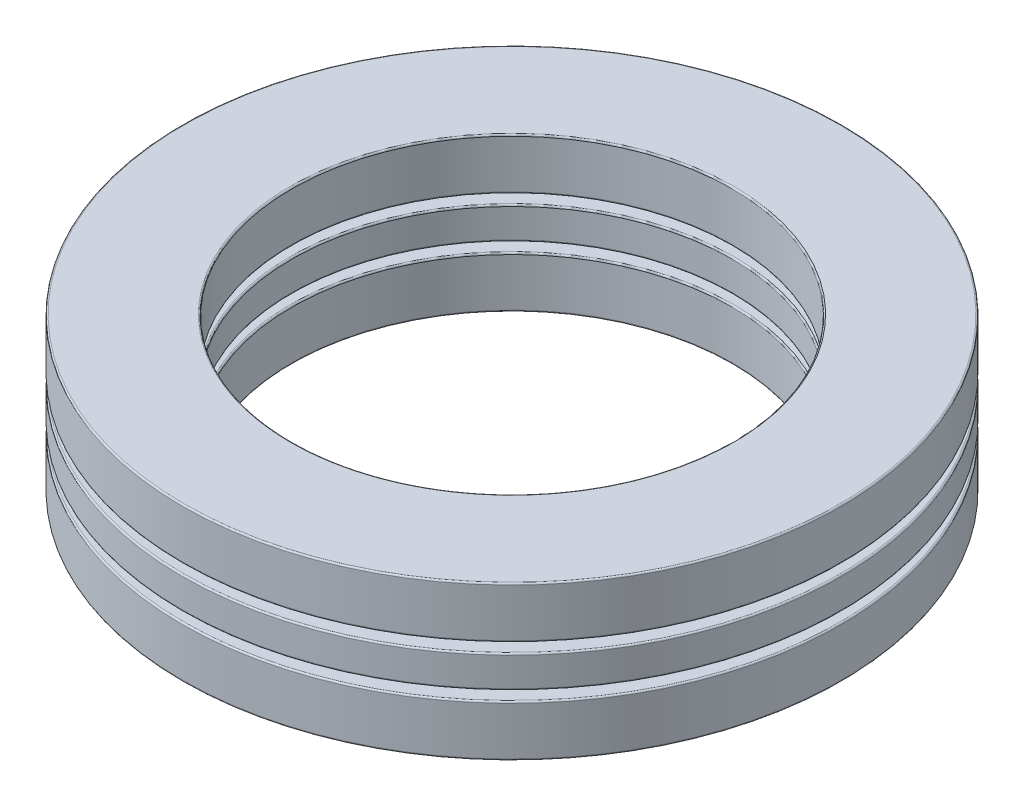
ISO-10303-21;
HEADER;
FILE_DESCRIPTION(('STEP AP214'),'2;1');
FILE_NAME('part.step','',(''),(''),'','','');
FILE_SCHEMA(('AUTOMOTIVE_DESIGN { 1 0 10303 214 1 1 1 1 }'));
ENDSEC;
DATA;
#1=APPLICATION_CONTEXT('core data for automotive mechanical design processes');
#2=APPLICATION_PROTOCOL_DEFINITION('international standard','automotive_design',2000,#1);
#3=PRODUCT_CONTEXT('',#1,'mechanical');
#4=PRODUCT('Part','Part','',(#3));
#5=PRODUCT_RELATED_PRODUCT_CATEGORY('part','',(#4));
#6=PRODUCT_DEFINITION_FORMATION('','',#4);
#7=PRODUCT_DEFINITION_CONTEXT('part definition',#1,'design');
#8=PRODUCT_DEFINITION('design','',#6,#7);
#9=PRODUCT_DEFINITION_SHAPE('','',#8);
#10=(LENGTH_UNIT() NAMED_UNIT(*) SI_UNIT(.MILLI.,.METRE.));
#11=(NAMED_UNIT(*) PLANE_ANGLE_UNIT() SI_UNIT($,.RADIAN.));
#12=(NAMED_UNIT(*) SI_UNIT($,.STERADIAN.) SOLID_ANGLE_UNIT());
#13=UNCERTAINTY_MEASURE_WITH_UNIT(LENGTH_MEASURE(1.E-05),#10,'distance_accuracy_value','');
#14=(GEOMETRIC_REPRESENTATION_CONTEXT(3) GLOBAL_UNCERTAINTY_ASSIGNED_CONTEXT((#13)) GLOBAL_UNIT_ASSIGNED_CONTEXT((#10,
#11,#12)) REPRESENTATION_CONTEXT('',''));
#15=CARTESIAN_POINT('',(0.,0.,0.));
#16=DIRECTION('',(0.,0.,1.));
#17=DIRECTION('',(1.,0.,0.));
#18=AXIS2_PLACEMENT_3D('',#15,#16,#17);
#19=CARTESIAN_POINT('',(0.,-5.5499,0.));
#20=DIRECTION('',(0.,-1.,0.));
#21=DIRECTION('',(0.,0.,-1.));
#22=AXIS2_PLACEMENT_3D('',#19,#20,#21);
#23=CYLINDRICAL_SURFACE('',#22,23.8125);
#24=CARTESIAN_POINT('',(0.,-5.438902,0.));
#25=DIRECTION('',(0.,1.,0.));
#26=DIRECTION('',(0.,0.,1.));
#27=AXIS2_PLACEMENT_3D('',#24,#25,#26);
#28=CIRCLE('',#27,23.8125);
#29=CARTESIAN_POINT('',(0.,-5.438902,23.8125));
#30=VERTEX_POINT('',#29);
#31=EDGE_CURVE('E11',#30,#30,#28,.T.);
#32=ORIENTED_EDGE('',*,*,#31,.T.);
#33=EDGE_LOOP('',(#32));
#34=FACE_BOUND('',#33,.T.);
#35=CARTESIAN_POINT('',(0.,-1.96096466666666,0.));
#36=DIRECTION('',(0.,-1.,0.));
#37=DIRECTION('',(0.,0.,-1.));
#38=AXIS2_PLACEMENT_3D('',#35,#36,#37);
#39=CIRCLE('',#38,23.8125);
#40=CARTESIAN_POINT('',(0.,-1.96096466666666,-23.8125));
#41=VERTEX_POINT('',#40);
#42=EDGE_CURVE('E49',#41,#41,#39,.T.);
#43=ORIENTED_EDGE('',*,*,#42,.T.);
#44=EDGE_LOOP('',(#43));
#45=FACE_BOUND('',#44,.T.);
#46=ADVANCED_FACE('F42',(#34,#45),#23,.T.);
#47=CARTESIAN_POINT('',(0.,-1.84996666666666,23.8125));
#48=DIRECTION('',(0.,-1.,0.));
#49=DIRECTION('',(0.,0.,-1.));
#50=AXIS2_PLACEMENT_3D('',#47,#48,#49);
#51=PLANE('',#50);
#52=CARTESIAN_POINT('',(0.,-1.84996666666666,0.));
#53=DIRECTION('',(0.,-1.,0.));
#54=DIRECTION('',(0.,0.,-1.));
#55=AXIS2_PLACEMENT_3D('',#52,#53,#54);
#56=CIRCLE('',#55,16.024098);
#57=CARTESIAN_POINT('',(0.,-1.84996666666666,-16.024098));
#58=VERTEX_POINT('',#57);
#59=EDGE_CURVE('E53',#58,#58,#56,.T.);
#60=ORIENTED_EDGE('',*,*,#59,.T.);
#61=EDGE_LOOP('',(#60));
#62=FACE_BOUND('',#61,.T.);
#63=CARTESIAN_POINT('',(0.,-1.84996666666666,0.));
#64=DIRECTION('',(0.,-1.,0.));
#65=DIRECTION('',(0.,0.,-1.));
#66=AXIS2_PLACEMENT_3D('',#63,#64,#65);
#67=CIRCLE('',#66,23.701502);
#68=CARTESIAN_POINT('',(0.,-1.84996666666666,-23.701502));
#69=VERTEX_POINT('',#68);
#70=EDGE_CURVE('E57',#69,#69,#67,.F.);
#71=ORIENTED_EDGE('',*,*,#70,.T.);
#72=EDGE_LOOP('',(#71));
#73=FACE_BOUND('',#72,.T.);
#74=ADVANCED_FACE('F85',(#62,#73),#51,.F.);
#75=CARTESIAN_POINT('',(0.,-5.5499,0.));
#76=DIRECTION('',(0.,-1.,0.));
#77=DIRECTION('',(0.,0.,-1.));
#78=AXIS2_PLACEMENT_3D('',#75,#76,#77);
#79=CYLINDRICAL_SURFACE('',#78,15.9131);
#80=CARTESIAN_POINT('',(0.,-5.438902,0.));
#81=DIRECTION('',(0.,1.,0.));
#82=DIRECTION('',(0.,0.,1.));
#83=AXIS2_PLACEMENT_3D('',#80,#81,#82);
#84=CIRCLE('',#83,15.9131);
#85=CARTESIAN_POINT('',(0.,-5.438902,15.9131));
#86=VERTEX_POINT('',#85);
#87=EDGE_CURVE('E68',#86,#86,#84,.F.);
#88=ORIENTED_EDGE('',*,*,#87,.T.);
#89=EDGE_LOOP('',(#88));
#90=FACE_BOUND('',#89,.T.);
#91=CARTESIAN_POINT('',(0.,-1.96096466666666,0.));
#92=DIRECTION('',(0.,-1.,0.));
#93=DIRECTION('',(0.,0.,-1.));
#94=AXIS2_PLACEMENT_3D('',#91,#92,#93);
#95=CIRCLE('',#94,15.9131);
#96=CARTESIAN_POINT('',(0.,-1.96096466666666,-15.9131));
#97=VERTEX_POINT('',#96);
#98=EDGE_CURVE('E71',#97,#97,#95,.F.);
#99=ORIENTED_EDGE('',*,*,#98,.T.);
#100=EDGE_LOOP('',(#99));
#101=FACE_BOUND('',#100,.T.);
#102=ADVANCED_FACE('F75',(#90,#101),#79,.F.);
#103=CARTESIAN_POINT('',(0.,-5.5499,23.8125));
#104=DIRECTION('',(0.,1.,0.));
#105=DIRECTION('',(0.,0.,1.));
#106=AXIS2_PLACEMENT_3D('',#103,#104,#105);
#107=PLANE('',#106);
#108=CARTESIAN_POINT('',(0.,-5.5499,0.));
#109=DIRECTION('',(0.,1.,0.));
#110=DIRECTION('',(0.,0.,1.));
#111=AXIS2_PLACEMENT_3D('',#108,#109,#110);
#112=CIRCLE('',#111,16.024098);
#113=CARTESIAN_POINT('',(0.,-5.5499,16.024098));
#114=VERTEX_POINT('',#113);
#115=EDGE_CURVE('E62',#114,#114,#112,.T.);
#116=ORIENTED_EDGE('',*,*,#115,.T.);
#117=EDGE_LOOP('',(#116));
#118=FACE_BOUND('',#117,.T.);
#119=CARTESIAN_POINT('',(0.,-5.5499,0.));
#120=DIRECTION('',(0.,1.,0.));
#121=DIRECTION('',(0.,0.,1.));
#122=AXIS2_PLACEMENT_3D('',#119,#120,#121);
#123=CIRCLE('',#122,23.701502);
#124=CARTESIAN_POINT('',(0.,-5.5499,23.701502));
#125=VERTEX_POINT('',#124);
#126=EDGE_CURVE('E65',#125,#125,#123,.F.);
#127=ORIENTED_EDGE('',*,*,#126,.T.);
#128=EDGE_LOOP('',(#127));
#129=FACE_BOUND('',#128,.T.);
#130=ADVANCED_FACE('F104',(#118,#129),#107,.F.);
#131=CARTESIAN_POINT('',(0.,-5.438902,0.));
#132=DIRECTION('',(0.,1.,0.));
#133=DIRECTION('',(0.,0.,1.));
#134=AXIS2_PLACEMENT_3D('',#131,#132,#133);
#135=TOROIDAL_SURFACE('',#134,16.024098,0.110998);
#136=ORIENTED_EDGE('',*,*,#115,.F.);
#137=EDGE_LOOP('',(#136));
#138=FACE_BOUND('',#137,.T.);
#139=ORIENTED_EDGE('',*,*,#87,.F.);
#140=EDGE_LOOP('',(#139));
#141=FACE_BOUND('',#140,.T.);
#142=ADVANCED_FACE('F81',(#138,#141),#135,.T.);
#143=CARTESIAN_POINT('',(0.,-1.96096466666666,0.));
#144=DIRECTION('',(0.,-1.,0.));
#145=DIRECTION('',(0.,0.,-1.));
#146=AXIS2_PLACEMENT_3D('',#143,#144,#145);
#147=TOROIDAL_SURFACE('',#146,16.024098,0.110998);
#148=ORIENTED_EDGE('',*,*,#98,.F.);
#149=EDGE_LOOP('',(#148));
#150=FACE_BOUND('',#149,.T.);
#151=ORIENTED_EDGE('',*,*,#59,.F.);
#152=EDGE_LOOP('',(#151));
#153=FACE_BOUND('',#152,.T.);
#154=ADVANCED_FACE('F77',(#150,#153),#147,.T.);
#155=CARTESIAN_POINT('',(0.,-5.438902,0.));
#156=DIRECTION('',(0.,1.,0.));
#157=DIRECTION('',(0.,0.,1.));
#158=AXIS2_PLACEMENT_3D('',#155,#156,#157);
#159=TOROIDAL_SURFACE('',#158,23.701502,0.110998);
#160=ORIENTED_EDGE('',*,*,#31,.F.);
#161=EDGE_LOOP('',(#160));
#162=FACE_BOUND('',#161,.T.);
#163=ORIENTED_EDGE('',*,*,#126,.F.);
#164=EDGE_LOOP('',(#163));
#165=FACE_BOUND('',#164,.T.);
#166=ADVANCED_FACE('F80',(#162,#165),#159,.T.);
#167=CARTESIAN_POINT('',(0.,-1.96096466666666,0.));
#168=DIRECTION('',(0.,-1.,0.));
#169=DIRECTION('',(0.,0.,-1.));
#170=AXIS2_PLACEMENT_3D('',#167,#168,#169);
#171=TOROIDAL_SURFACE('',#170,23.701502,0.110998);
#172=ORIENTED_EDGE('',*,*,#70,.F.);
#173=EDGE_LOOP('',(#172));
#174=FACE_BOUND('',#173,.T.);
#175=ORIENTED_EDGE('',*,*,#42,.F.);
#176=EDGE_LOOP('',(#175));
#177=FACE_BOUND('',#176,.T.);
#178=ADVANCED_FACE('F44',(#174,#177),#171,.T.);
#179=CLOSED_SHELL('',(#46,#74,#102,#130,#142,#154,#166,#178));
#180=MANIFOLD_SOLID_BREP('B2_NOT_SHOWN',#179);
#181=CARTESIAN_POINT('',(0.,-5.5499,0.));
#182=DIRECTION('',(0.,-1.,0.));
#183=DIRECTION('',(0.,0.,-1.));
#184=AXIS2_PLACEMENT_3D('',#181,#182,#183);
#185=CYLINDRICAL_SURFACE('',#184,23.8125);
#186=CARTESIAN_POINT('',(0.,1.96096466666667,0.));
#187=DIRECTION('',(0.,1.,0.));
#188=DIRECTION('',(0.,0.,1.));
#189=AXIS2_PLACEMENT_3D('',#186,#187,#188);
#190=CIRCLE('',#189,23.8125);
#191=CARTESIAN_POINT('',(0.,1.96096466666667,23.8125));
#192=VERTEX_POINT('',#191);
#193=EDGE_CURVE('E41',#192,#192,#190,.T.);
#194=ORIENTED_EDGE('',*,*,#193,.T.);
#195=EDGE_LOOP('',(#194));
#196=FACE_BOUND('',#195,.T.);
#197=CARTESIAN_POINT('',(0.,5.438902,0.));
#198=DIRECTION('',(0.,-1.,0.));
#199=DIRECTION('',(0.,0.,-1.));
#200=AXIS2_PLACEMENT_3D('',#197,#198,#199);
#201=CIRCLE('',#200,23.8125);
#202=CARTESIAN_POINT('',(0.,5.438902,-23.8125));
#203=VERTEX_POINT('',#202);
#204=EDGE_CURVE('E177',#203,#203,#201,.T.);
#205=ORIENTED_EDGE('',*,*,#204,.T.);
#206=EDGE_LOOP('',(#205));
#207=FACE_BOUND('',#206,.T.);
#208=ADVANCED_FACE('F170',(#196,#207),#185,.T.);
#209=CARTESIAN_POINT('',(0.,5.5499,23.8125));
#210=DIRECTION('',(0.,-1.,0.));
#211=DIRECTION('',(0.,0.,-1.));
#212=AXIS2_PLACEMENT_3D('',#209,#210,#211);
#213=PLANE('',#212);
#214=CARTESIAN_POINT('',(0.,5.5499,0.));
#215=DIRECTION('',(0.,-1.,0.));
#216=DIRECTION('',(0.,0.,-1.));
#217=AXIS2_PLACEMENT_3D('',#214,#215,#216);
#218=CIRCLE('',#217,16.024098);
#219=CARTESIAN_POINT('',(0.,5.5499,-16.024098));
#220=VERTEX_POINT('',#219);
#221=EDGE_CURVE('E181',#220,#220,#218,.T.);
#222=ORIENTED_EDGE('',*,*,#221,.T.);
#223=EDGE_LOOP('',(#222));
#224=FACE_BOUND('',#223,.T.);
#225=CARTESIAN_POINT('',(0.,5.5499,0.));
#226=DIRECTION('',(0.,-1.,0.));
#227=DIRECTION('',(0.,0.,-1.));
#228=AXIS2_PLACEMENT_3D('',#225,#226,#227);
#229=CIRCLE('',#228,23.701502);
#230=CARTESIAN_POINT('',(0.,5.5499,-23.701502));
#231=VERTEX_POINT('',#230);
#232=EDGE_CURVE('E185',#231,#231,#229,.F.);
#233=ORIENTED_EDGE('',*,*,#232,.T.);
#234=EDGE_LOOP('',(#233));
#235=FACE_BOUND('',#234,.T.);
#236=ADVANCED_FACE('F213',(#224,#235),#213,.F.);
#237=CARTESIAN_POINT('',(0.,-5.5499,0.));
#238=DIRECTION('',(0.,-1.,0.));
#239=DIRECTION('',(0.,0.,-1.));
#240=AXIS2_PLACEMENT_3D('',#237,#238,#239);
#241=CYLINDRICAL_SURFACE('',#240,15.9131);
#242=CARTESIAN_POINT('',(0.,1.96096466666667,0.));
#243=DIRECTION('',(0.,1.,0.));
#244=DIRECTION('',(0.,0.,1.));
#245=AXIS2_PLACEMENT_3D('',#242,#243,#244);
#246=CIRCLE('',#245,15.9131);
#247=CARTESIAN_POINT('',(0.,1.96096466666667,15.9131));
#248=VERTEX_POINT('',#247);
#249=EDGE_CURVE('E196',#248,#248,#246,.F.);
#250=ORIENTED_EDGE('',*,*,#249,.T.);
#251=EDGE_LOOP('',(#250));
#252=FACE_BOUND('',#251,.T.);
#253=CARTESIAN_POINT('',(0.,5.438902,0.));
#254=DIRECTION('',(0.,-1.,0.));
#255=DIRECTION('',(0.,0.,-1.));
#256=AXIS2_PLACEMENT_3D('',#253,#254,#255);
#257=CIRCLE('',#256,15.9131);
#258=CARTESIAN_POINT('',(0.,5.438902,-15.9131));
#259=VERTEX_POINT('',#258);
#260=EDGE_CURVE('E199',#259,#259,#257,.F.);
#261=ORIENTED_EDGE('',*,*,#260,.T.);
#262=EDGE_LOOP('',(#261));
#263=FACE_BOUND('',#262,.T.);
#264=ADVANCED_FACE('F203',(#252,#263),#241,.F.);
#265=CARTESIAN_POINT('',(0.,1.84996666666667,23.8125));
#266=DIRECTION('',(0.,1.,0.));
#267=DIRECTION('',(0.,0.,1.));
#268=AXIS2_PLACEMENT_3D('',#265,#266,#267);
#269=PLANE('',#268);
#270=CARTESIAN_POINT('',(0.,1.84996666666667,0.));
#271=DIRECTION('',(0.,1.,0.));
#272=DIRECTION('',(0.,0.,1.));
#273=AXIS2_PLACEMENT_3D('',#270,#271,#272);
#274=CIRCLE('',#273,16.024098);
#275=CARTESIAN_POINT('',(0.,1.84996666666667,16.024098));
#276=VERTEX_POINT('',#275);
#277=EDGE_CURVE('E190',#276,#276,#274,.T.);
#278=ORIENTED_EDGE('',*,*,#277,.T.);
#279=EDGE_LOOP('',(#278));
#280=FACE_BOUND('',#279,.T.);
#281=CARTESIAN_POINT('',(0.,1.84996666666667,0.));
#282=DIRECTION('',(0.,1.,0.));
#283=DIRECTION('',(0.,0.,1.));
#284=AXIS2_PLACEMENT_3D('',#281,#282,#283);
#285=CIRCLE('',#284,23.701502);
#286=CARTESIAN_POINT('',(0.,1.84996666666667,23.701502));
#287=VERTEX_POINT('',#286);
#288=EDGE_CURVE('E193',#287,#287,#285,.F.);
#289=ORIENTED_EDGE('',*,*,#288,.T.);
#290=EDGE_LOOP('',(#289));
#291=FACE_BOUND('',#290,.T.);
#292=ADVANCED_FACE('F232',(#280,#291),#269,.F.);
#293=CARTESIAN_POINT('',(0.,1.96096466666667,0.));
#294=DIRECTION('',(0.,1.,0.));
#295=DIRECTION('',(0.,0.,1.));
#296=AXIS2_PLACEMENT_3D('',#293,#294,#295);
#297=TOROIDAL_SURFACE('',#296,16.024098,0.110998);
#298=ORIENTED_EDGE('',*,*,#277,.F.);
#299=EDGE_LOOP('',(#298));
#300=FACE_BOUND('',#299,.T.);
#301=ORIENTED_EDGE('',*,*,#249,.F.);
#302=EDGE_LOOP('',(#301));
#303=FACE_BOUND('',#302,.T.);
#304=ADVANCED_FACE('F209',(#300,#303),#297,.T.);
#305=CARTESIAN_POINT('',(0.,5.438902,0.));
#306=DIRECTION('',(0.,-1.,0.));
#307=DIRECTION('',(0.,0.,-1.));
#308=AXIS2_PLACEMENT_3D('',#305,#306,#307);
#309=TOROIDAL_SURFACE('',#308,16.024098,0.110998);
#310=ORIENTED_EDGE('',*,*,#260,.F.);
#311=EDGE_LOOP('',(#310));
#312=FACE_BOUND('',#311,.T.);
#313=ORIENTED_EDGE('',*,*,#221,.F.);
#314=EDGE_LOOP('',(#313));
#315=FACE_BOUND('',#314,.T.);
#316=ADVANCED_FACE('F205',(#312,#315),#309,.T.);
#317=CARTESIAN_POINT('',(0.,1.96096466666667,0.));
#318=DIRECTION('',(0.,1.,0.));
#319=DIRECTION('',(0.,0.,1.));
#320=AXIS2_PLACEMENT_3D('',#317,#318,#319);
#321=TOROIDAL_SURFACE('',#320,23.701502,0.110998);
#322=ORIENTED_EDGE('',*,*,#193,.F.);
#323=EDGE_LOOP('',(#322));
#324=FACE_BOUND('',#323,.T.);
#325=ORIENTED_EDGE('',*,*,#288,.F.);
#326=EDGE_LOOP('',(#325));
#327=FACE_BOUND('',#326,.T.);
#328=ADVANCED_FACE('F208',(#324,#327),#321,.T.);
#329=CARTESIAN_POINT('',(0.,5.438902,0.));
#330=DIRECTION('',(0.,-1.,0.));
#331=DIRECTION('',(0.,0.,-1.));
#332=AXIS2_PLACEMENT_3D('',#329,#330,#331);
#333=TOROIDAL_SURFACE('',#332,23.701502,0.110998);
#334=ORIENTED_EDGE('',*,*,#232,.F.);
#335=EDGE_LOOP('',(#334));
#336=FACE_BOUND('',#335,.T.);
#337=ORIENTED_EDGE('',*,*,#204,.F.);
#338=EDGE_LOOP('',(#337));
#339=FACE_BOUND('',#338,.T.);
#340=ADVANCED_FACE('F172',(#336,#339),#333,.T.);
#341=CLOSED_SHELL('',(#208,#236,#264,#292,#304,#316,#328,#340));
#342=MANIFOLD_SOLID_BREP('B6_NOT_SHOWN',#341);
#343=CARTESIAN_POINT('',(-12.7675617336816,0.,15.2157875647838));
#344=DIRECTION('',(0.,1.,0.));
#345=DIRECTION('',(0.64278760968653,0.,-0.766044443118986));
#346=AXIS2_PLACEMENT_3D('',#343,#344,#345);
#347=SPHERICAL_SURFACE('',#346,1.84996666666667);
#348=CARTESIAN_POINT('',(-12.7675617336816,1.84996666666667,15.2157875647838));
#349=VERTEX_POINT('',#348);
#350=VERTEX_LOOP('',#349);
#351=FACE_BOUND('',#350,.T.);
#352=ADVANCED_FACE('F298',(#351),#347,.T.);
#353=CLOSED_SHELL('',(#352));
#354=MANIFOLD_SOLID_BREP('B36',#353);
#355=CARTESIAN_POINT('',(-19.5610394365308,0.,3.4491390233629));
#356=DIRECTION('',(0.,1.,0.));
#357=DIRECTION('',(0.984807753012206,0.,-0.17364817766694));
#358=AXIS2_PLACEMENT_3D('',#355,#356,#357);
#359=SPHERICAL_SURFACE('',#358,1.84996666666667);
#360=CARTESIAN_POINT('',(-19.5610394365308,1.84996666666667,3.4491390233629));
#361=VERTEX_POINT('',#360);
#362=VERTEX_LOOP('',#361);
#363=FACE_BOUND('',#362,.T.);
#364=ADVANCED_FACE('F317',(#363),#359,.T.);
#365=CLOSED_SHELL('',(#364));
#366=MANIFOLD_SOLID_BREP('B166',#365);
#367=CARTESIAN_POINT('',(-17.2016893902896,0.,-9.93139999999984));
#368=DIRECTION('',(0.,1.,0.));
#369=DIRECTION('',(0.866025403784443,0.,0.499999999999992));
#370=AXIS2_PLACEMENT_3D('',#367,#368,#369);
#371=SPHERICAL_SURFACE('',#370,1.84996666666667);
#372=CARTESIAN_POINT('',(-17.2016893902896,1.84996666666667,-9.93139999999984));
#373=VERTEX_POINT('',#372);
#374=VERTEX_LOOP('',#373);
#375=FACE_BOUND('',#374,.T.);
#376=ADVANCED_FACE('F336',(#375),#371,.T.);
#377=CLOSED_SHELL('',(#376));
#378=MANIFOLD_SOLID_BREP('B294',#377);
#379=CARTESIAN_POINT('',(-6.79347770284923,0.,-18.6649265881463));
#380=DIRECTION('',(0.,1.,0.));
#381=DIRECTION('',(0.342020143325676,0.,0.939692620785906));
#382=AXIS2_PLACEMENT_3D('',#379,#380,#381);
#383=SPHERICAL_SURFACE('',#382,1.84996666666667);
#384=CARTESIAN_POINT('',(-6.79347770284923,1.84996666666667,-18.6649265881463));
#385=VERTEX_POINT('',#384);
#386=VERTEX_LOOP('',#385);
#387=FACE_BOUND('',#386,.T.);
#388=ADVANCED_FACE('F355',(#387),#383,.T.);
#389=CLOSED_SHELL('',(#388));
#390=MANIFOLD_SOLID_BREP('B313',#389);
#391=CARTESIAN_POINT('',(6.79347770284898,0.,-18.6649265881464));
#392=DIRECTION('',(0.,1.,0.));
#393=DIRECTION('',(-0.342020143325663,0.,0.939692620785911));
#394=AXIS2_PLACEMENT_3D('',#391,#392,#393);
#395=SPHERICAL_SURFACE('',#394,1.84996666666667);
#396=CARTESIAN_POINT('',(6.79347770284898,1.84996666666667,-18.6649265881464));
#397=VERTEX_POINT('',#396);
#398=VERTEX_LOOP('',#397);
#399=FACE_BOUND('',#398,.T.);
#400=ADVANCED_FACE('F374',(#399),#395,.T.);
#401=CLOSED_SHELL('',(#400));
#402=MANIFOLD_SOLID_BREP('B332',#401);
#403=CARTESIAN_POINT('',(17.2016893902895,0.,-9.93140000000008));
#404=DIRECTION('',(0.,1.,0.));
#405=DIRECTION('',(-0.866025403784436,0.,0.500000000000004));
#406=AXIS2_PLACEMENT_3D('',#403,#404,#405);
#407=SPHERICAL_SURFACE('',#406,1.84996666666667);
#408=CARTESIAN_POINT('',(17.2016893902895,1.84996666666667,-9.93140000000008));
#409=VERTEX_POINT('',#408);
#410=VERTEX_LOOP('',#409);
#411=FACE_BOUND('',#410,.T.);
#412=ADVANCED_FACE('F393',(#411),#407,.T.);
#413=CLOSED_SHELL('',(#412));
#414=MANIFOLD_SOLID_BREP('B351',#413);
#415=CARTESIAN_POINT('',(19.5610394365309,0.,3.44913902336264));
#416=DIRECTION('',(0.,1.,0.));
#417=DIRECTION('',(-0.984807753012209,0.,-0.173648177666927));
#418=AXIS2_PLACEMENT_3D('',#415,#416,#417);
#419=SPHERICAL_SURFACE('',#418,1.84996666666667);
#420=CARTESIAN_POINT('',(19.5610394365309,1.84996666666667,3.44913902336264));
#421=VERTEX_POINT('',#420);
#422=VERTEX_LOOP('',#421);
#423=FACE_BOUND('',#422,.T.);
#424=ADVANCED_FACE('F412',(#423),#419,.T.);
#425=CLOSED_SHELL('',(#424));
#426=MANIFOLD_SOLID_BREP('B370',#425);
#427=CARTESIAN_POINT('',(12.7675617336818,0.,15.2157875647836));
#428=DIRECTION('',(0.,1.,0.));
#429=DIRECTION('',(-0.642787609686541,0.,-0.766044443118977));
#430=AXIS2_PLACEMENT_3D('',#427,#428,#429);
#431=SPHERICAL_SURFACE('',#430,1.84996666666667);
#432=CARTESIAN_POINT('',(12.7675617336818,1.84996666666667,15.2157875647836));
#433=VERTEX_POINT('',#432);
#434=VERTEX_LOOP('',#433);
#435=FACE_BOUND('',#434,.T.);
#436=ADVANCED_FACE('F431',(#435),#431,.T.);
#437=CLOSED_SHELL('',(#436));
#438=MANIFOLD_SOLID_BREP('B389',#437);
#439=CARTESIAN_POINT('',(0.,0.,19.8628));
#440=DIRECTION('',(0.,1.,0.));
#441=DIRECTION('',(0.,0.,-1.));
#442=AXIS2_PLACEMENT_3D('',#439,#440,#441);
#443=SPHERICAL_SURFACE('',#442,1.84996666666667);
#444=CARTESIAN_POINT('',(0.,1.84996666666667,19.8628));
#445=VERTEX_POINT('',#444);
#446=VERTEX_LOOP('',#445);
#447=FACE_BOUND('',#446,.T.);
#448=ADVANCED_FACE('F451',(#447),#443,.T.);
#449=CLOSED_SHELL('',(#448));
#450=MANIFOLD_SOLID_BREP('B408',#449);
#451=CARTESIAN_POINT('',(0.,-5.5499,0.));
#452=DIRECTION('',(0.,-1.,0.));
#453=DIRECTION('',(0.,0.,-1.));
#454=AXIS2_PLACEMENT_3D('',#451,#452,#453);
#455=CYLINDRICAL_SURFACE('',#454,23.8125);
#456=CARTESIAN_POINT('',(0.,-1.04523116666667,0.));
#457=DIRECTION('',(0.,1.,0.));
#458=DIRECTION('',(0.,0.,1.));
#459=AXIS2_PLACEMENT_3D('',#456,#457,#458);
#460=CIRCLE('',#459,23.8125);
#461=CARTESIAN_POINT('',(0.,-1.04523116666667,23.8125));
#462=VERTEX_POINT('',#461);
#463=EDGE_CURVE('E450',#462,#462,#460,.T.);
#464=ORIENTED_EDGE('',*,*,#463,.T.);
#465=EDGE_LOOP('',(#464));
#466=FACE_BOUND('',#465,.T.);
#467=CARTESIAN_POINT('',(0.,1.04523116666666,0.));
#468=DIRECTION('',(0.,-1.,0.));
#469=DIRECTION('',(0.,0.,-1.));
#470=AXIS2_PLACEMENT_3D('',#467,#468,#469);
#471=CIRCLE('',#470,23.8125);
#472=CARTESIAN_POINT('',(0.,1.04523116666666,-23.8125));
#473=VERTEX_POINT('',#472);
#474=EDGE_CURVE('E471',#473,#473,#471,.T.);
#475=ORIENTED_EDGE('',*,*,#474,.T.);
#476=EDGE_LOOP('',(#475));
#477=FACE_BOUND('',#476,.T.);
#478=ADVANCED_FACE('F464',(#466,#477),#455,.T.);
#479=CARTESIAN_POINT('',(0.,-1.15622916666667,23.8125));
#480=DIRECTION('',(0.,1.,0.));
#481=DIRECTION('',(0.,0.,1.));
#482=AXIS2_PLACEMENT_3D('',#479,#480,#481);
#483=PLANE('',#482);
#484=CARTESIAN_POINT('',(0.,-1.15622916666667,0.));
#485=DIRECTION('',(0.,1.,0.));
#486=DIRECTION('',(0.,0.,1.));
#487=AXIS2_PLACEMENT_3D('',#484,#485,#486);
#488=CIRCLE('',#487,16.024098);
#489=CARTESIAN_POINT('',(0.,-1.15622916666667,16.024098));
#490=VERTEX_POINT('',#489);
#491=EDGE_CURVE('E484',#490,#490,#488,.T.);
#492=ORIENTED_EDGE('',*,*,#491,.T.);
#493=EDGE_LOOP('',(#492));
#494=FACE_BOUND('',#493,.T.);
#495=CARTESIAN_POINT('',(0.,-1.15622916666667,0.));
#496=DIRECTION('',(0.,1.,0.));
#497=DIRECTION('',(0.,0.,1.));
#498=AXIS2_PLACEMENT_3D('',#495,#496,#497);
#499=CIRCLE('',#498,23.701502);
#500=CARTESIAN_POINT('',(0.,-1.15622916666667,23.701502));
#501=VERTEX_POINT('',#500);
#502=EDGE_CURVE('E487',#501,#501,#499,.F.);
#503=ORIENTED_EDGE('',*,*,#502,.T.);
#504=EDGE_LOOP('',(#503));
#505=FACE_BOUND('',#504,.T.);
#506=CARTESIAN_POINT('',(-12.7675617336816,-1.15622916666667,15.2157875647838));
#507=DIRECTION('',(0.,1.,0.));
#508=DIRECTION('',(-0.64278760968653,0.,0.766044443118986));
#509=AXIS2_PLACEMENT_3D('',#506,#507,#508);
#510=CIRCLE('',#509,1.44412976630463);
#511=CARTESIAN_POINT('',(-13.6958304542417,-1.15622916666667,16.3220551474042));
#512=VERTEX_POINT('',#511);
#513=EDGE_CURVE('E544',#512,#512,#510,.T.);
#514=ORIENTED_EDGE('',*,*,#513,.T.);
#515=EDGE_LOOP('',(#514));
#516=FACE_BOUND('',#515,.T.);
#517=CARTESIAN_POINT('',(-19.5610394365308,-1.15622916666667,3.4491390233629));
#518=DIRECTION('',(0.,1.,0.));
#519=DIRECTION('',(-0.984807753012206,0.,0.17364817766694));
#520=AXIS2_PLACEMENT_3D('',#517,#518,#519);
#521=CIRCLE('',#520,1.44412976630463);
#522=CARTESIAN_POINT('',(-20.9832296267434,-1.15622916666667,3.69990952559629));
#523=VERTEX_POINT('',#522);
#524=EDGE_CURVE('E538',#523,#523,#521,.T.);
#525=ORIENTED_EDGE('',*,*,#524,.T.);
#526=EDGE_LOOP('',(#525));
#527=FACE_BOUND('',#526,.T.);
#528=CARTESIAN_POINT('',(-17.2016893902896,-1.15622916666667,-9.93139999999984));
#529=DIRECTION('',(0.,1.,0.));
#530=DIRECTION('',(-0.866025403784443,0.,-0.499999999999992));
#531=AXIS2_PLACEMENT_3D('',#528,#529,#530);
#532=CIRCLE('',#531,1.44412976630463);
#533=CARTESIAN_POINT('',(-18.4523424542707,-1.15622916666667,-10.6534648831521));
#534=VERTEX_POINT('',#533);
#535=EDGE_CURVE('E532',#534,#534,#532,.T.);
#536=ORIENTED_EDGE('',*,*,#535,.T.);
#537=EDGE_LOOP('',(#536));
#538=FACE_BOUND('',#537,.T.);
#539=CARTESIAN_POINT('',(-6.79347770284923,-1.15622916666667,-18.6649265881463));
#540=DIRECTION('',(0.,1.,0.));
#541=DIRECTION('',(-0.342020143325676,0.,-0.939692620785906));
#542=AXIS2_PLACEMENT_3D('',#539,#540,#541);
#543=CIRCLE('',#542,1.44412976630463);
#544=CARTESIAN_POINT('',(-7.28739917250162,-1.15622916666667,-20.021964673));
#545=VERTEX_POINT('',#544);
#546=EDGE_CURVE('E526',#545,#545,#543,.T.);
#547=ORIENTED_EDGE('',*,*,#546,.T.);
#548=EDGE_LOOP('',(#547));
#549=FACE_BOUND('',#548,.T.);
#550=CARTESIAN_POINT('',(6.79347770284898,-1.15622916666667,-18.6649265881464));
#551=DIRECTION('',(0.,1.,0.));
#552=DIRECTION('',(0.342020143325663,0.,-0.939692620785911));
#553=AXIS2_PLACEMENT_3D('',#550,#551,#552);
#554=CIRCLE('',#553,1.44412976630463);
#555=CARTESIAN_POINT('',(7.28739917250135,-1.15622916666667,-20.0219646730001));
#556=VERTEX_POINT('',#555);
#557=EDGE_CURVE('E520',#556,#556,#554,.T.);
#558=ORIENTED_EDGE('',*,*,#557,.T.);
#559=EDGE_LOOP('',(#558));
#560=FACE_BOUND('',#559,.T.);
#561=CARTESIAN_POINT('',(17.2016893902895,-1.15622916666667,-9.93140000000008));
#562=DIRECTION('',(0.,1.,0.));
#563=DIRECTION('',(0.866025403784436,0.,-0.500000000000004));
#564=AXIS2_PLACEMENT_3D('',#561,#562,#563);
#565=CIRCLE('',#564,1.44412976630463);
#566=CARTESIAN_POINT('',(18.4523424542706,-1.15622916666667,-10.6534648831524));
#567=VERTEX_POINT('',#566);
#568=EDGE_CURVE('E514',#567,#567,#565,.T.);
#569=ORIENTED_EDGE('',*,*,#568,.T.);
#570=EDGE_LOOP('',(#569));
#571=FACE_BOUND('',#570,.T.);
#572=CARTESIAN_POINT('',(19.5610394365309,-1.15622916666667,3.44913902336264));
#573=DIRECTION('',(0.,1.,0.));
#574=DIRECTION('',(0.984807753012209,0.,0.173648177666927));
#575=AXIS2_PLACEMENT_3D('',#572,#573,#574);
#576=CIRCLE('',#575,1.44412976630463);
#577=CARTESIAN_POINT('',(20.9832296267434,-1.15622916666667,3.69990952559601));
#578=VERTEX_POINT('',#577);
#579=EDGE_CURVE('E508',#578,#578,#576,.T.);
#580=ORIENTED_EDGE('',*,*,#579,.T.);
#581=EDGE_LOOP('',(#580));
#582=FACE_BOUND('',#581,.T.);
#583=CARTESIAN_POINT('',(12.7675617336818,-1.15622916666667,15.2157875647836));
#584=DIRECTION('',(0.,1.,0.));
#585=DIRECTION('',(0.642787609686541,0.,0.766044443118977));
#586=AXIS2_PLACEMENT_3D('',#583,#584,#585);
#587=CIRCLE('',#586,1.44412976630463);
#588=CARTESIAN_POINT('',(13.695830454242,-1.15622916666667,16.322055147404));
#589=VERTEX_POINT('',#588);
#590=EDGE_CURVE('E500',#589,#589,#587,.T.);
#591=ORIENTED_EDGE('',*,*,#590,.T.);
#592=EDGE_LOOP('',(#591));
#593=FACE_BOUND('',#592,.T.);
#594=CARTESIAN_POINT('',(0.,-1.15622916666667,19.8628));
#595=DIRECTION('',(0.,1.,0.));
#596=DIRECTION('',(0.,0.,1.));
#597=AXIS2_PLACEMENT_3D('',#594,#595,#596);
#598=CIRCLE('',#597,1.44412976630463);
#599=CARTESIAN_POINT('',(0.,-1.15622916666667,21.3069297663046));
#600=VERTEX_POINT('',#599);
#601=EDGE_CURVE('E496',#600,#600,#598,.T.);
#602=ORIENTED_EDGE('',*,*,#601,.T.);
#603=EDGE_LOOP('',(#602));
#604=FACE_BOUND('',#603,.T.);
#605=ADVANCED_FACE('F562',(#494,#505,#516,#527,#538,#549,#560,#571,#582,#593,#604),#483,.F.);
#606=CARTESIAN_POINT('',(0.,-5.5499,0.));
#607=DIRECTION('',(0.,-1.,0.));
#608=DIRECTION('',(0.,0.,-1.));
#609=AXIS2_PLACEMENT_3D('',#606,#607,#608);
#610=CYLINDRICAL_SURFACE('',#609,15.9131);
#611=CARTESIAN_POINT('',(0.,-1.04523116666667,0.));
#612=DIRECTION('',(0.,1.,0.));
#613=DIRECTION('',(0.,0.,1.));
#614=AXIS2_PLACEMENT_3D('',#611,#612,#613);
#615=CIRCLE('',#614,15.9131);
#616=CARTESIAN_POINT('',(0.,-1.04523116666667,15.9131));
#617=VERTEX_POINT('',#616);
#618=EDGE_CURVE('E490',#617,#617,#615,.F.);
#619=ORIENTED_EDGE('',*,*,#618,.T.);
#620=EDGE_LOOP('',(#619));
#621=FACE_BOUND('',#620,.T.);
#622=CARTESIAN_POINT('',(0.,1.04523116666666,0.));
#623=DIRECTION('',(0.,-1.,0.));
#624=DIRECTION('',(0.,0.,-1.));
#625=AXIS2_PLACEMENT_3D('',#622,#623,#624);
#626=CIRCLE('',#625,15.9131);
#627=CARTESIAN_POINT('',(0.,1.04523116666666,-15.9131));
#628=VERTEX_POINT('',#627);
#629=EDGE_CURVE('E493',#628,#628,#626,.F.);
#630=ORIENTED_EDGE('',*,*,#629,.T.);
#631=EDGE_LOOP('',(#630));
#632=FACE_BOUND('',#631,.T.);
#633=ADVANCED_FACE('F565',(#621,#632),#610,.F.);
#634=CARTESIAN_POINT('',(0.,1.15622916666666,23.8125));
#635=DIRECTION('',(0.,-1.,0.));
#636=DIRECTION('',(0.,0.,-1.));
#637=AXIS2_PLACEMENT_3D('',#634,#635,#636);
#638=PLANE('',#637);
#639=CARTESIAN_POINT('',(0.,1.15622916666666,0.));
#640=DIRECTION('',(0.,-1.,0.));
#641=DIRECTION('',(0.,0.,-1.));
#642=AXIS2_PLACEMENT_3D('',#639,#640,#641);
#643=CIRCLE('',#642,16.024098);
#644=CARTESIAN_POINT('',(0.,1.15622916666666,-16.024098));
#645=VERTEX_POINT('',#644);
#646=EDGE_CURVE('E475',#645,#645,#643,.T.);
#647=ORIENTED_EDGE('',*,*,#646,.T.);
#648=EDGE_LOOP('',(#647));
#649=FACE_BOUND('',#648,.T.);
#650=CARTESIAN_POINT('',(0.,1.15622916666666,0.));
#651=DIRECTION('',(0.,-1.,0.));
#652=DIRECTION('',(0.,0.,-1.));
#653=AXIS2_PLACEMENT_3D('',#650,#651,#652);
#654=CIRCLE('',#653,23.701502);
#655=CARTESIAN_POINT('',(0.,1.15622916666666,-23.701502));
#656=VERTEX_POINT('',#655);
#657=EDGE_CURVE('E479',#656,#656,#654,.F.);
#658=ORIENTED_EDGE('',*,*,#657,.T.);
#659=EDGE_LOOP('',(#658));
#660=FACE_BOUND('',#659,.T.);
#661=CARTESIAN_POINT('',(-12.7675617336816,1.15622916666666,15.2157875647838));
#662=DIRECTION('',(0.,-1.,0.));
#663=DIRECTION('',(0.64278760968653,0.,-0.766044443118986));
#664=AXIS2_PLACEMENT_3D('',#661,#662,#663);
#665=CIRCLE('',#664,1.44412976630464);
#666=CARTESIAN_POINT('',(-11.8392930131215,1.15622916666666,14.1095199821634));
#667=VERTEX_POINT('',#666);
#668=EDGE_CURVE('E547',#667,#667,#665,.T.);
#669=ORIENTED_EDGE('',*,*,#668,.T.);
#670=EDGE_LOOP('',(#669));
#671=FACE_BOUND('',#670,.T.);
#672=CARTESIAN_POINT('',(-19.5610394365308,1.15622916666666,3.4491390233629));
#673=DIRECTION('',(0.,-1.,0.));
#674=DIRECTION('',(0.984807753012206,0.,-0.17364817766694));
#675=AXIS2_PLACEMENT_3D('',#672,#673,#674);
#676=CIRCLE('',#675,1.44412976630464);
#677=CARTESIAN_POINT('',(-18.1388492463183,1.15622916666666,3.19836852112952));
#678=VERTEX_POINT('',#677);
#679=EDGE_CURVE('E541',#678,#678,#676,.T.);
#680=ORIENTED_EDGE('',*,*,#679,.T.);
#681=EDGE_LOOP('',(#680));
#682=FACE_BOUND('',#681,.T.);
#683=CARTESIAN_POINT('',(-17.2016893902896,1.15622916666666,-9.93139999999984));
#684=DIRECTION('',(0.,-1.,0.));
#685=DIRECTION('',(0.866025403784443,0.,0.499999999999992));
#686=AXIS2_PLACEMENT_3D('',#683,#684,#685);
#687=CIRCLE('',#686,1.44412976630464);
#688=CARTESIAN_POINT('',(-15.9510363263085,1.15622916666666,-9.20933511684753));
#689=VERTEX_POINT('',#688);
#690=EDGE_CURVE('E535',#689,#689,#687,.T.);
#691=ORIENTED_EDGE('',*,*,#690,.T.);
#692=EDGE_LOOP('',(#691));
#693=FACE_BOUND('',#692,.T.);
#694=CARTESIAN_POINT('',(-6.79347770284923,1.15622916666666,-18.6649265881463));
#695=DIRECTION('',(0.,-1.,0.));
#696=DIRECTION('',(0.342020143325676,0.,0.939692620785906));
#697=AXIS2_PLACEMENT_3D('',#694,#695,#696);
#698=CIRCLE('',#697,1.44412976630464);
#699=CARTESIAN_POINT('',(-6.29955623319684,1.15622916666666,-17.3078885032925));
#700=VERTEX_POINT('',#699);
#701=EDGE_CURVE('E529',#700,#700,#698,.T.);
#702=ORIENTED_EDGE('',*,*,#701,.T.);
#703=EDGE_LOOP('',(#702));
#704=FACE_BOUND('',#703,.T.);
#705=CARTESIAN_POINT('',(6.79347770284898,1.15622916666666,-18.6649265881464));
#706=DIRECTION('',(0.,-1.,0.));
#707=DIRECTION('',(-0.342020143325663,0.,0.939692620785911));
#708=AXIS2_PLACEMENT_3D('',#705,#706,#707);
#709=CIRCLE('',#708,1.44412976630464);
#710=CARTESIAN_POINT('',(6.29955623319661,1.15622916666666,-17.3078885032926));
#711=VERTEX_POINT('',#710);
#712=EDGE_CURVE('E523',#711,#711,#709,.T.);
#713=ORIENTED_EDGE('',*,*,#712,.T.);
#714=EDGE_LOOP('',(#713));
#715=FACE_BOUND('',#714,.T.);
#716=CARTESIAN_POINT('',(17.2016893902895,1.15622916666666,-9.93140000000008));
#717=DIRECTION('',(0.,-1.,0.));
#718=DIRECTION('',(-0.866025403784436,0.,0.500000000000004));
#719=AXIS2_PLACEMENT_3D('',#716,#717,#718);
#720=CIRCLE('',#719,1.44412976630464);
#721=CARTESIAN_POINT('',(15.9510363263084,1.15622916666666,-9.20933511684776));
#722=VERTEX_POINT('',#721);
#723=EDGE_CURVE('E517',#722,#722,#720,.T.);
#724=ORIENTED_EDGE('',*,*,#723,.T.);
#725=EDGE_LOOP('',(#724));
#726=FACE_BOUND('',#725,.T.);
#727=CARTESIAN_POINT('',(19.5610394365309,1.15622916666666,3.44913902336264));
#728=DIRECTION('',(0.,-1.,0.));
#729=DIRECTION('',(-0.984807753012209,0.,-0.173648177666927));
#730=AXIS2_PLACEMENT_3D('',#727,#728,#729);
#731=CIRCLE('',#730,1.44412976630464);
#732=CARTESIAN_POINT('',(18.1388492463184,1.15622916666666,3.19836852112928));
#733=VERTEX_POINT('',#732);
#734=EDGE_CURVE('E511',#733,#733,#731,.T.);
#735=ORIENTED_EDGE('',*,*,#734,.T.);
#736=EDGE_LOOP('',(#735));
#737=FACE_BOUND('',#736,.T.);
#738=CARTESIAN_POINT('',(12.7675617336818,1.15622916666666,15.2157875647836));
#739=DIRECTION('',(0.,-1.,0.));
#740=DIRECTION('',(-0.642787609686541,0.,-0.766044443118977));
#741=AXIS2_PLACEMENT_3D('',#738,#739,#740);
#742=CIRCLE('',#741,1.44412976630464);
#743=CARTESIAN_POINT('',(11.8392930131217,1.15622916666666,14.1095199821632));
#744=VERTEX_POINT('',#743);
#745=EDGE_CURVE('E505',#744,#744,#742,.T.);
#746=ORIENTED_EDGE('',*,*,#745,.T.);
#747=EDGE_LOOP('',(#746));
#748=FACE_BOUND('',#747,.T.);
#749=CARTESIAN_POINT('',(0.,1.15622916666666,19.8628));
#750=DIRECTION('',(0.,-1.,0.));
#751=DIRECTION('',(0.,0.,-1.));
#752=AXIS2_PLACEMENT_3D('',#749,#750,#751);
#753=CIRCLE('',#752,1.44412976630464);
#754=CARTESIAN_POINT('',(0.,1.15622916666666,18.4186702336954));
#755=VERTEX_POINT('',#754);
#756=EDGE_CURVE('E497',#755,#755,#753,.T.);
#757=ORIENTED_EDGE('',*,*,#756,.T.);
#758=EDGE_LOOP('',(#757));
#759=FACE_BOUND('',#758,.T.);
#760=ADVANCED_FACE('F551',(#649,#660,#671,#682,#693,#704,#715,#726,#737,#748,#759),#638,.F.);
#761=CARTESIAN_POINT('',(0.,0.,19.8628));
#762=DIRECTION('',(0.,1.,0.));
#763=DIRECTION('',(0.,0.,-1.));
#764=AXIS2_PLACEMENT_3D('',#761,#762,#763);
#765=SPHERICAL_SURFACE('',#764,1.84996666666667);
#766=ORIENTED_EDGE('',*,*,#756,.F.);
#767=EDGE_LOOP('',(#766));
#768=FACE_BOUND('',#767,.T.);
#769=ORIENTED_EDGE('',*,*,#601,.F.);
#770=EDGE_LOOP('',(#769));
#771=FACE_BOUND('',#770,.T.);
#772=ADVANCED_FACE('F584',(#768,#771),#765,.F.);
#773=CARTESIAN_POINT('',(12.7675617336818,0.,15.2157875647836));
#774=DIRECTION('',(0.,1.,0.));
#775=DIRECTION('',(-0.642787609686541,0.,-0.766044443118977));
#776=AXIS2_PLACEMENT_3D('',#773,#774,#775);
#777=SPHERICAL_SURFACE('',#776,1.84996666666667);
#778=ORIENTED_EDGE('',*,*,#745,.F.);
#779=EDGE_LOOP('',(#778));
#780=FACE_BOUND('',#779,.T.);
#781=ORIENTED_EDGE('',*,*,#590,.F.);
#782=EDGE_LOOP('',(#781));
#783=FACE_BOUND('',#782,.T.);
#784=ADVANCED_FACE('F586',(#780,#783),#777,.F.);
#785=CARTESIAN_POINT('',(19.5610394365309,0.,3.44913902336264));
#786=DIRECTION('',(0.,1.,0.));
#787=DIRECTION('',(-0.984807753012209,0.,-0.173648177666927));
#788=AXIS2_PLACEMENT_3D('',#785,#786,#787);
#789=SPHERICAL_SURFACE('',#788,1.84996666666667);
#790=ORIENTED_EDGE('',*,*,#734,.F.);
#791=EDGE_LOOP('',(#790));
#792=FACE_BOUND('',#791,.T.);
#793=ORIENTED_EDGE('',*,*,#579,.F.);
#794=EDGE_LOOP('',(#793));
#795=FACE_BOUND('',#794,.T.);
#796=ADVANCED_FACE('F593',(#792,#795),#789,.F.);
#797=CARTESIAN_POINT('',(17.2016893902895,0.,-9.93140000000008));
#798=DIRECTION('',(0.,1.,0.));
#799=DIRECTION('',(-0.866025403784436,0.,0.500000000000004));
#800=AXIS2_PLACEMENT_3D('',#797,#798,#799);
#801=SPHERICAL_SURFACE('',#800,1.84996666666667);
#802=ORIENTED_EDGE('',*,*,#723,.F.);
#803=EDGE_LOOP('',(#802));
#804=FACE_BOUND('',#803,.T.);
#805=ORIENTED_EDGE('',*,*,#568,.F.);
#806=EDGE_LOOP('',(#805));
#807=FACE_BOUND('',#806,.T.);
#808=ADVANCED_FACE('F712',(#804,#807),#801,.F.);
#809=CARTESIAN_POINT('',(6.79347770284898,0.,-18.6649265881464));
#810=DIRECTION('',(0.,1.,0.));
#811=DIRECTION('',(-0.342020143325663,0.,0.939692620785911));
#812=AXIS2_PLACEMENT_3D('',#809,#810,#811);
#813=SPHERICAL_SURFACE('',#812,1.84996666666667);
#814=ORIENTED_EDGE('',*,*,#712,.F.);
#815=EDGE_LOOP('',(#814));
#816=FACE_BOUND('',#815,.T.);
#817=ORIENTED_EDGE('',*,*,#557,.F.);
#818=EDGE_LOOP('',(#817));
#819=FACE_BOUND('',#818,.T.);
#820=ADVANCED_FACE('F702',(#816,#819),#813,.F.);
#821=CARTESIAN_POINT('',(-6.79347770284923,0.,-18.6649265881463));
#822=DIRECTION('',(0.,1.,0.));
#823=DIRECTION('',(0.342020143325676,0.,0.939692620785906));
#824=AXIS2_PLACEMENT_3D('',#821,#822,#823);
#825=SPHERICAL_SURFACE('',#824,1.84996666666667);
#826=ORIENTED_EDGE('',*,*,#701,.F.);
#827=EDGE_LOOP('',(#826));
#828=FACE_BOUND('',#827,.T.);
#829=ORIENTED_EDGE('',*,*,#546,.F.);
#830=EDGE_LOOP('',(#829));
#831=FACE_BOUND('',#830,.T.);
#832=ADVANCED_FACE('F692',(#828,#831),#825,.F.);
#833=CARTESIAN_POINT('',(-17.2016893902896,0.,-9.93139999999984));
#834=DIRECTION('',(0.,1.,0.));
#835=DIRECTION('',(0.866025403784443,0.,0.499999999999992));
#836=AXIS2_PLACEMENT_3D('',#833,#834,#835);
#837=SPHERICAL_SURFACE('',#836,1.84996666666667);
#838=ORIENTED_EDGE('',*,*,#690,.F.);
#839=EDGE_LOOP('',(#838));
#840=FACE_BOUND('',#839,.T.);
#841=ORIENTED_EDGE('',*,*,#535,.F.);
#842=EDGE_LOOP('',(#841));
#843=FACE_BOUND('',#842,.T.);
#844=ADVANCED_FACE('F682',(#840,#843),#837,.F.);
#845=CARTESIAN_POINT('',(-19.5610394365308,0.,3.4491390233629));
#846=DIRECTION('',(0.,1.,0.));
#847=DIRECTION('',(0.984807753012206,0.,-0.17364817766694));
#848=AXIS2_PLACEMENT_3D('',#845,#846,#847);
#849=SPHERICAL_SURFACE('',#848,1.84996666666667);
#850=ORIENTED_EDGE('',*,*,#679,.F.);
#851=EDGE_LOOP('',(#850));
#852=FACE_BOUND('',#851,.T.);
#853=ORIENTED_EDGE('',*,*,#524,.F.);
#854=EDGE_LOOP('',(#853));
#855=FACE_BOUND('',#854,.T.);
#856=ADVANCED_FACE('F558',(#852,#855),#849,.F.);
#857=CARTESIAN_POINT('',(-12.7675617336816,0.,15.2157875647838));
#858=DIRECTION('',(0.,1.,0.));
#859=DIRECTION('',(0.64278760968653,0.,-0.766044443118986));
#860=AXIS2_PLACEMENT_3D('',#857,#858,#859);
#861=SPHERICAL_SURFACE('',#860,1.84996666666667);
#862=ORIENTED_EDGE('',*,*,#668,.F.);
#863=EDGE_LOOP('',(#862));
#864=FACE_BOUND('',#863,.T.);
#865=ORIENTED_EDGE('',*,*,#513,.F.);
#866=EDGE_LOOP('',(#865));
#867=FACE_BOUND('',#866,.T.);
#868=ADVANCED_FACE('F554',(#864,#867),#861,.F.);
#869=CARTESIAN_POINT('',(0.,-1.04523116666667,0.));
#870=DIRECTION('',(0.,1.,0.));
#871=DIRECTION('',(0.,0.,1.));
#872=AXIS2_PLACEMENT_3D('',#869,#870,#871);
#873=TOROIDAL_SURFACE('',#872,16.024098,0.110998);
#874=ORIENTED_EDGE('',*,*,#491,.F.);
#875=EDGE_LOOP('',(#874));
#876=FACE_BOUND('',#875,.T.);
#877=ORIENTED_EDGE('',*,*,#618,.F.);
#878=EDGE_LOOP('',(#877));
#879=FACE_BOUND('',#878,.T.);
#880=ADVANCED_FACE('F557',(#876,#879),#873,.T.);
#881=CARTESIAN_POINT('',(0.,1.04523116666666,0.));
#882=DIRECTION('',(0.,-1.,0.));
#883=DIRECTION('',(0.,0.,-1.));
#884=AXIS2_PLACEMENT_3D('',#881,#882,#883);
#885=TOROIDAL_SURFACE('',#884,16.024098,0.110998);
#886=ORIENTED_EDGE('',*,*,#629,.F.);
#887=EDGE_LOOP('',(#886));
#888=FACE_BOUND('',#887,.T.);
#889=ORIENTED_EDGE('',*,*,#646,.F.);
#890=EDGE_LOOP('',(#889));
#891=FACE_BOUND('',#890,.T.);
#892=ADVANCED_FACE('F607',(#888,#891),#885,.T.);
#893=CARTESIAN_POINT('',(0.,-1.04523116666667,0.));
#894=DIRECTION('',(0.,1.,0.));
#895=DIRECTION('',(0.,0.,1.));
#896=AXIS2_PLACEMENT_3D('',#893,#894,#895);
#897=TOROIDAL_SURFACE('',#896,23.701502,0.110998);
#898=ORIENTED_EDGE('',*,*,#463,.F.);
#899=EDGE_LOOP('',(#898));
#900=FACE_BOUND('',#899,.T.);
#901=ORIENTED_EDGE('',*,*,#502,.F.);
#902=EDGE_LOOP('',(#901));
#903=FACE_BOUND('',#902,.T.);
#904=ADVANCED_FACE('F610',(#900,#903),#897,.T.);
#905=CARTESIAN_POINT('',(0.,1.04523116666666,0.));
#906=DIRECTION('',(0.,-1.,0.));
#907=DIRECTION('',(0.,0.,-1.));
#908=AXIS2_PLACEMENT_3D('',#905,#906,#907);
#909=TOROIDAL_SURFACE('',#908,23.701502,0.110998);
#910=ORIENTED_EDGE('',*,*,#657,.F.);
#911=EDGE_LOOP('',(#910));
#912=FACE_BOUND('',#911,.T.);
#913=ORIENTED_EDGE('',*,*,#474,.F.);
#914=EDGE_LOOP('',(#913));
#915=FACE_BOUND('',#914,.T.);
#916=ADVANCED_FACE('F466',(#912,#915),#909,.T.);
#917=CLOSED_SHELL('',(#478,#605,#633,#760,#772,#784,#796,#808,#820,#832,#844,#856,#868,#880,
#892,#904,#916));
#918=MANIFOLD_SOLID_BREP('B427',#917);
#919=ADVANCED_BREP_SHAPE_REPRESENTATION('',(#18,#180,#342,#354,#366,#378,#390,#402,#414,#426,
#438,#450,#918),#14);
#920=SHAPE_DEFINITION_REPRESENTATION(#9,#919);
ENDSEC;
END-ISO-10303-21;
